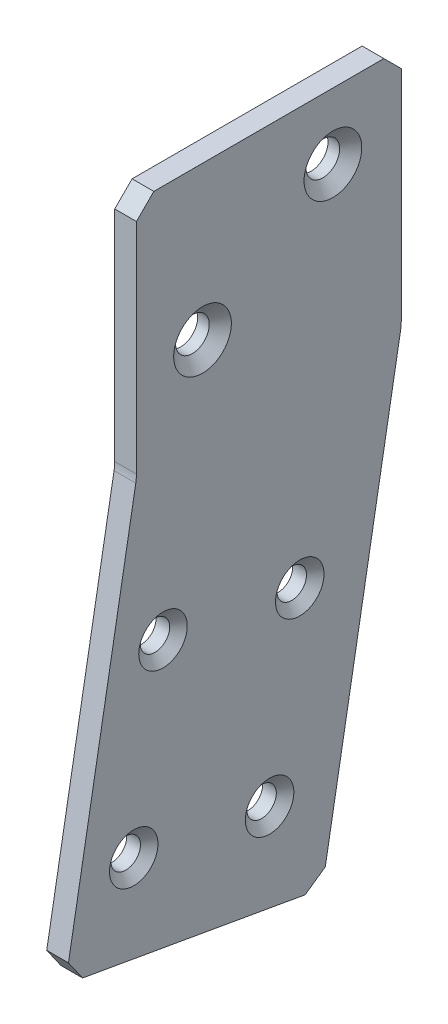
ISO-10303-21;
HEADER;
FILE_DESCRIPTION(('STEP AP214'),'2;1');
FILE_NAME('part.step','',(''),(''),'','','');
FILE_SCHEMA(('AUTOMOTIVE_DESIGN { 1 0 10303 214 1 1 1 1 }'));
ENDSEC;
DATA;
#1=APPLICATION_CONTEXT('core data for automotive mechanical design processes');
#2=APPLICATION_PROTOCOL_DEFINITION('international standard','automotive_design',2000,#1);
#3=PRODUCT_CONTEXT('',#1,'mechanical');
#4=PRODUCT('Part','Part','',(#3));
#5=PRODUCT_RELATED_PRODUCT_CATEGORY('part','',(#4));
#6=PRODUCT_DEFINITION_FORMATION('','',#4);
#7=PRODUCT_DEFINITION_CONTEXT('part definition',#1,'design');
#8=PRODUCT_DEFINITION('design','',#6,#7);
#9=PRODUCT_DEFINITION_SHAPE('','',#8);
#10=(LENGTH_UNIT() NAMED_UNIT(*) SI_UNIT(.MILLI.,.METRE.));
#11=(NAMED_UNIT(*) PLANE_ANGLE_UNIT() SI_UNIT($,.RADIAN.));
#12=(NAMED_UNIT(*) SI_UNIT($,.STERADIAN.) SOLID_ANGLE_UNIT());
#13=UNCERTAINTY_MEASURE_WITH_UNIT(LENGTH_MEASURE(1.E-05),#10,'distance_accuracy_value','');
#14=(GEOMETRIC_REPRESENTATION_CONTEXT(3) GLOBAL_UNCERTAINTY_ASSIGNED_CONTEXT((#13)) GLOBAL_UNIT_ASSIGNED_CONTEXT((#10,
#11,#12)) REPRESENTATION_CONTEXT('',''));
#15=CARTESIAN_POINT('',(0.,0.,0.));
#16=DIRECTION('',(0.,0.,1.));
#17=DIRECTION('',(1.,0.,0.));
#18=AXIS2_PLACEMENT_3D('',#15,#16,#17);
#19=CARTESIAN_POINT('',(8.21082796489774,230.070458845019,-147.775624550014));
#20=DIRECTION('',(0.,0.984807753012208,-0.17364817766693));
#21=DIRECTION('',(0.,0.17364817766693,0.984807753012208));
#22=AXIS2_PLACEMENT_3D('',#19,#20,#21);
#23=PLANE('',#22);
#24=DIRECTION('',(0.,0.17364817766693,0.984807753012208));
#25=VECTOR('',#24,1.);
#26=CARTESIAN_POINT('',(5.03582796489774,230.070458845019,-147.775624550014));
#27=LINE('',#26,#25);
#28=CARTESIAN_POINT('',(5.03582796489774,230.511525216293,-145.274212857363));
#29=VERTEX_POINT('',#28);
#30=CARTESIAN_POINT('',(5.03582796489774,236.245388042855,-112.755860852901));
#31=VERTEX_POINT('',#30);
#32=EDGE_CURVE('E176',#29,#31,#27,.T.);
#33=ORIENTED_EDGE('',*,*,#32,.F.);
#34=DIRECTION('',(-1.,0.,0.));
#35=VECTOR('',#34,1.);
#36=CARTESIAN_POINT('',(8.21082796489774,230.511525216293,-145.274212857363));
#37=LINE('',#36,#35);
#38=CARTESIAN_POINT('',(8.21082796489774,230.511525216293,-145.274212857363));
#39=VERTEX_POINT('',#38);
#40=EDGE_CURVE('E211',#39,#29,#37,.T.);
#41=ORIENTED_EDGE('',*,*,#40,.F.);
#42=DIRECTION('',(0.,0.17364817766693,0.984807753012208));
#43=VECTOR('',#42,1.);
#44=CARTESIAN_POINT('',(8.21082796489774,230.070458845019,-147.775624550014));
#45=LINE('',#44,#43);
#46=CARTESIAN_POINT('',(8.21082796489774,236.245388042855,-112.755860852901));
#47=VERTEX_POINT('',#46);
#48=EDGE_CURVE('E184',#39,#47,#45,.T.);
#49=ORIENTED_EDGE('',*,*,#48,.T.);
#50=DIRECTION('',(1.,0.,0.));
#51=VECTOR('',#50,1.);
#52=CARTESIAN_POINT('',(8.21082796489774,236.245388042855,-112.755860852901));
#53=LINE('',#52,#51);
#54=EDGE_CURVE('E214',#31,#47,#53,.T.);
#55=ORIENTED_EDGE('',*,*,#54,.F.);
#56=EDGE_LOOP('',(#33,#41,#49,#55));
#57=FACE_BOUND('',#56,.T.);
#58=ADVANCED_FACE('F43',(#57),#23,.F.);
#59=CARTESIAN_POINT('',(8.21082796489774,236.686454414129,-110.25444916025));
#60=DIRECTION('',(0.,-0.173648177666931,-0.984807753012208));
#61=DIRECTION('',(0.,0.984807753012208,-0.173648177666931));
#62=AXIS2_PLACEMENT_3D('',#59,#60,#61);
#63=PLANE('',#62);
#64=DIRECTION('',(0.,0.984807753012208,-0.173648177666931));
#65=VECTOR('',#64,1.);
#66=CARTESIAN_POINT('',(8.21082796489774,236.686454414129,-110.25444916025));
#67=LINE('',#66,#65);
#68=CARTESIAN_POINT('',(8.21082796489774,239.18786610678,-110.695515531524));
#69=VERTEX_POINT('',#68);
#70=CARTESIAN_POINT('',(8.21082796489771,294.96406401821,-120.530364104645));
#71=VERTEX_POINT('',#70);
#72=EDGE_CURVE('E248',#69,#71,#67,.T.);
#73=ORIENTED_EDGE('',*,*,#72,.T.);
#74=DIRECTION('',(-1.,0.,0.));
#75=VECTOR('',#74,1.);
#76=CARTESIAN_POINT('',(8.21082796489771,294.96406401821,-120.530364104645));
#77=LINE('',#76,#75);
#78=CARTESIAN_POINT('',(5.03582796489771,294.96406401821,-120.530364104645));
#79=VERTEX_POINT('',#78);
#80=EDGE_CURVE('E162',#79,#71,#77,.F.);
#81=ORIENTED_EDGE('',*,*,#80,.F.);
#82=DIRECTION('',(0.,0.984807753012208,-0.173648177666931));
#83=VECTOR('',#82,1.);
#84=CARTESIAN_POINT('',(5.03582796489774,236.686454414129,-110.25444916025));
#85=LINE('',#84,#83);
#86=CARTESIAN_POINT('',(5.03582796489773,239.18786610678,-110.695515531524));
#87=VERTEX_POINT('',#86);
#88=EDGE_CURVE('E147',#87,#79,#85,.T.);
#89=ORIENTED_EDGE('',*,*,#88,.F.);
#90=DIRECTION('',(-1.,0.,0.));
#91=VECTOR('',#90,1.);
#92=CARTESIAN_POINT('',(8.21082796489774,239.18786610678,-110.695515531524));
#93=LINE('',#92,#91);
#94=EDGE_CURVE('E199',#69,#87,#93,.T.);
#95=ORIENTED_EDGE('',*,*,#94,.F.);
#96=EDGE_LOOP('',(#73,#81,#89,#95));
#97=FACE_BOUND('',#96,.T.);
#98=ADVANCED_FACE('F272',(#97),#63,.F.);
#99=CARTESIAN_POINT('',(8.2108279648977,330.563176933005,-120.626834873017));
#100=DIRECTION('',(0.,0.,-1.));
#101=DIRECTION('',(0.,1.,0.));
#102=AXIS2_PLACEMENT_3D('',#99,#100,#101);
#103=PLANE('',#102);
#104=DIRECTION('',(0.,1.,0.));
#105=VECTOR('',#104,1.);
#106=CARTESIAN_POINT('',(5.0358279648977,330.563176933005,-120.626834873017));
#107=LINE('',#106,#105);
#108=CARTESIAN_POINT('',(5.03582796489771,296.066729946395,-120.626834873017));
#109=VERTEX_POINT('',#108);
#110=CARTESIAN_POINT('',(5.0358279648977,328.023176933005,-120.626834873017));
#111=VERTEX_POINT('',#110);
#112=EDGE_CURVE('E145',#109,#111,#107,.T.);
#113=ORIENTED_EDGE('',*,*,#112,.F.);
#114=DIRECTION('',(-1.,0.,0.));
#115=VECTOR('',#114,1.);
#116=CARTESIAN_POINT('',(5.03582796489771,296.066729946395,-120.626834873017));
#117=LINE('',#116,#115);
#118=CARTESIAN_POINT('',(8.21082796489771,296.066729946395,-120.626834873017));
#119=VERTEX_POINT('',#118);
#120=EDGE_CURVE('E156',#119,#109,#117,.T.);
#121=ORIENTED_EDGE('',*,*,#120,.F.);
#122=DIRECTION('',(0.,1.,0.));
#123=VECTOR('',#122,1.);
#124=CARTESIAN_POINT('',(8.2108279648977,330.563176933005,-120.626834873017));
#125=LINE('',#124,#123);
#126=CARTESIAN_POINT('',(8.2108279648977,328.023176933005,-120.626834873017));
#127=VERTEX_POINT('',#126);
#128=EDGE_CURVE('E243',#119,#127,#125,.T.);
#129=ORIENTED_EDGE('',*,*,#128,.T.);
#130=DIRECTION('',(1.,0.,0.));
#131=VECTOR('',#130,1.);
#132=CARTESIAN_POINT('',(8.2108279648977,328.023176933005,-120.626834873017));
#133=LINE('',#132,#131);
#134=EDGE_CURVE('E11',#111,#127,#133,.T.);
#135=ORIENTED_EDGE('',*,*,#134,.F.);
#136=EDGE_LOOP('',(#113,#121,#129,#135));
#137=FACE_BOUND('',#136,.T.);
#138=ADVANCED_FACE('F166',(#137),#103,.F.);
#139=CARTESIAN_POINT('',(8.2108279648977,330.563176933005,-159.314588785863));
#140=DIRECTION('',(0.,-1.,0.));
#141=DIRECTION('',(-1.,0.,0.));
#142=AXIS2_PLACEMENT_3D('',#139,#140,#141);
#143=PLANE('',#142);
#144=DIRECTION('',(0.,0.,-1.));
#145=VECTOR('',#144,1.);
#146=CARTESIAN_POINT('',(5.0358279648977,330.563176933005,-159.314588785863));
#147=LINE('',#146,#145);
#148=CARTESIAN_POINT('',(5.0358279648977,330.563176933005,-123.166834873017));
#149=VERTEX_POINT('',#148);
#150=CARTESIAN_POINT('',(5.0358279648977,330.563176933005,-156.774588785863));
#151=VERTEX_POINT('',#150);
#152=EDGE_CURVE('E168',#149,#151,#147,.T.);
#153=ORIENTED_EDGE('',*,*,#152,.F.);
#154=DIRECTION('',(-1.,0.,0.));
#155=VECTOR('',#154,1.);
#156=CARTESIAN_POINT('',(8.2108279648977,330.563176933005,-123.166834873017));
#157=LINE('',#156,#155);
#158=CARTESIAN_POINT('',(8.2108279648977,330.563176933005,-123.166834873017));
#159=VERTEX_POINT('',#158);
#160=EDGE_CURVE('E230',#159,#149,#157,.T.);
#161=ORIENTED_EDGE('',*,*,#160,.F.);
#162=DIRECTION('',(0.,0.,-1.));
#163=VECTOR('',#162,1.);
#164=CARTESIAN_POINT('',(8.2108279648977,330.563176933005,-159.314588785863));
#165=LINE('',#164,#163);
#166=CARTESIAN_POINT('',(8.2108279648977,330.563176933005,-156.774588785863));
#167=VERTEX_POINT('',#166);
#168=EDGE_CURVE('E239',#159,#167,#165,.T.);
#169=ORIENTED_EDGE('',*,*,#168,.T.);
#170=DIRECTION('',(1.,0.,0.));
#171=VECTOR('',#170,1.);
#172=CARTESIAN_POINT('',(8.2108279648977,330.563176933005,-156.774588785863));
#173=LINE('',#172,#171);
#174=EDGE_CURVE('E52',#151,#167,#173,.T.);
#175=ORIENTED_EDGE('',*,*,#174,.F.);
#176=EDGE_LOOP('',(#153,#161,#169,#175));
#177=FACE_BOUND('',#176,.T.);
#178=ADVANCED_FACE('F240',(#177),#143,.F.);
#179=CARTESIAN_POINT('',(8.21082796489771,295.511176933005,-159.314588785863));
#180=DIRECTION('',(0.,0.,1.));
#181=DIRECTION('',(0.,-1.,0.));
#182=AXIS2_PLACEMENT_3D('',#179,#180,#181);
#183=PLANE('',#182);
#184=DIRECTION('',(0.,-1.,0.));
#185=VECTOR('',#184,1.);
#186=CARTESIAN_POINT('',(8.21082796489771,295.511176933005,-159.314588785863));
#187=LINE('',#186,#185);
#188=CARTESIAN_POINT('',(8.2108279648977,328.023176933005,-159.314588785863));
#189=VERTEX_POINT('',#188);
#190=CARTESIAN_POINT('',(8.21082796489771,296.066729946395,-159.314588785863));
#191=VERTEX_POINT('',#190);
#192=EDGE_CURVE('E242',#189,#191,#187,.T.);
#193=ORIENTED_EDGE('',*,*,#192,.T.);
#194=DIRECTION('',(-1.,0.,0.));
#195=VECTOR('',#194,1.);
#196=CARTESIAN_POINT('',(8.21082796489771,296.066729946395,-159.314588785863));
#197=LINE('',#196,#195);
#198=CARTESIAN_POINT('',(5.03582796489771,296.066729946395,-159.314588785863));
#199=VERTEX_POINT('',#198);
#200=EDGE_CURVE('E193',#199,#191,#197,.F.);
#201=ORIENTED_EDGE('',*,*,#200,.F.);
#202=DIRECTION('',(0.,-1.,0.));
#203=VECTOR('',#202,1.);
#204=CARTESIAN_POINT('',(5.03582796489771,295.511176933005,-159.314588785863));
#205=LINE('',#204,#203);
#206=CARTESIAN_POINT('',(5.0358279648977,328.023176933005,-159.314588785863));
#207=VERTEX_POINT('',#206);
#208=EDGE_CURVE('E173',#207,#199,#205,.T.);
#209=ORIENTED_EDGE('',*,*,#208,.F.);
#210=DIRECTION('',(-1.,0.,0.));
#211=VECTOR('',#210,1.);
#212=CARTESIAN_POINT('',(8.2108279648977,328.023176933005,-159.314588785863));
#213=LINE('',#212,#211);
#214=EDGE_CURVE('E227',#189,#207,#213,.T.);
#215=ORIENTED_EDGE('',*,*,#214,.F.);
#216=EDGE_LOOP('',(#193,#201,#209,#215));
#217=FACE_BOUND('',#216,.T.);
#218=ADVANCED_FACE('F278',(#217),#183,.F.);
#219=CARTESIAN_POINT('',(8.21082796489774,230.070458845019,-147.775624550014));
#220=DIRECTION('',(0.,0.173648177666931,0.984807753012208));
#221=DIRECTION('',(0.,-0.984807753012208,0.173648177666931));
#222=AXIS2_PLACEMENT_3D('',#219,#220,#221);
#223=PLANE('',#222);
#224=DIRECTION('',(0.,-0.984807753012208,0.173648177666931));
#225=VECTOR('',#224,1.);
#226=CARTESIAN_POINT('',(5.03582796489774,230.070458845019,-147.775624550014));
#227=LINE('',#226,#225);
#228=CARTESIAN_POINT('',(5.03582796489771,294.96406401821,-159.21811801749));
#229=VERTEX_POINT('',#228);
#230=CARTESIAN_POINT('',(5.03582796489774,232.57187053767,-148.216690921288));
#231=VERTEX_POINT('',#230);
#232=EDGE_CURVE('E182',#229,#231,#227,.T.);
#233=ORIENTED_EDGE('',*,*,#232,.F.);
#234=DIRECTION('',(-1.,0.,0.));
#235=VECTOR('',#234,1.);
#236=CARTESIAN_POINT('',(8.21082796489771,294.96406401821,-159.21811801749));
#237=LINE('',#236,#235);
#238=CARTESIAN_POINT('',(8.21082796489771,294.96406401821,-159.21811801749));
#239=VERTEX_POINT('',#238);
#240=EDGE_CURVE('E188',#239,#229,#237,.T.);
#241=ORIENTED_EDGE('',*,*,#240,.F.);
#242=DIRECTION('',(0.,-0.984807753012208,0.173648177666931));
#243=VECTOR('',#242,1.);
#244=CARTESIAN_POINT('',(8.21082796489774,230.070458845019,-147.775624550014));
#245=LINE('',#244,#243);
#246=CARTESIAN_POINT('',(8.21082796489774,232.57187053767,-148.216690921288));
#247=VERTEX_POINT('',#246);
#248=EDGE_CURVE('E163',#239,#247,#245,.T.);
#249=ORIENTED_EDGE('',*,*,#248,.T.);
#250=DIRECTION('',(1.,0.,0.));
#251=VECTOR('',#250,1.);
#252=CARTESIAN_POINT('',(8.21082796489774,232.57187053767,-148.216690921288));
#253=LINE('',#252,#251);
#254=EDGE_CURVE('E224',#231,#247,#253,.T.);
#255=ORIENTED_EDGE('',*,*,#254,.F.);
#256=EDGE_LOOP('',(#233,#241,#249,#255));
#257=FACE_BOUND('',#256,.T.);
#258=ADVANCED_FACE('F286',(#257),#223,.F.);
#259=CARTESIAN_POINT('',(8.21082796489783,0.,0.));
#260=DIRECTION('',(1.,0.,0.));
#261=DIRECTION('',(0.,-1.,0.));
#262=AXIS2_PLACEMENT_3D('',#259,#260,#261);
#263=PLANE('',#262);
#264=CARTESIAN_POINT('',(8.2108279648977,320.911176933005,-149.328834873017));
#265=DIRECTION('',(-1.,0.,0.));
#266=DIRECTION('',(0.,0.,1.));
#267=AXIS2_PLACEMENT_3D('',#264,#265,#266);
#268=CIRCLE('',#267,4.21640000000001);
#269=CARTESIAN_POINT('',(8.2108279648977,320.911176933005,-145.112434873017));
#270=VERTEX_POINT('',#269);
#271=EDGE_CURVE('E514',#270,#270,#268,.T.);
#272=ORIENTED_EDGE('',*,*,#271,.T.);
#273=EDGE_LOOP('',(#272));
#274=FACE_BOUND('',#273,.T.);
#275=CARTESIAN_POINT('',(8.21082796489771,308.211176933005,-130.278834873017));
#276=DIRECTION('',(-1.,0.,0.));
#277=DIRECTION('',(0.,0.,1.));
#278=AXIS2_PLACEMENT_3D('',#275,#276,#277);
#279=CIRCLE('',#278,4.21640000000001);
#280=CARTESIAN_POINT('',(8.21082796489771,308.211176933005,-126.062434873017));
#281=VERTEX_POINT('',#280);
#282=EDGE_CURVE('E518',#281,#281,#279,.T.);
#283=ORIENTED_EDGE('',*,*,#282,.T.);
#284=EDGE_LOOP('',(#283));
#285=FACE_BOUND('',#284,.T.);
#286=CARTESIAN_POINT('',(8.21082796489772,273.13941545584,-124.504125042983));
#287=DIRECTION('',(-1.,0.,0.));
#288=DIRECTION('',(0.,0.,1.));
#289=AXIS2_PLACEMENT_3D('',#286,#287,#288);
#290=CIRCLE('',#289,3.54329999999997);
#291=CARTESIAN_POINT('',(8.21082796489772,273.13941545584,-120.960825042983));
#292=VERTEX_POINT('',#291);
#293=EDGE_CURVE('E534',#292,#292,#290,.T.);
#294=ORIENTED_EDGE('',*,*,#293,.T.);
#295=EDGE_LOOP('',(#294));
#296=FACE_BOUND('',#295,.T.);
#297=CARTESIAN_POINT('',(8.21082796489772,269.72417914843,-144.485224024571));
#298=DIRECTION('',(-1.,0.,0.));
#299=DIRECTION('',(0.,0.,1.));
#300=AXIS2_PLACEMENT_3D('',#297,#298,#299);
#301=CIRCLE('',#300,3.54329999999997);
#302=CARTESIAN_POINT('',(8.21082796489772,269.72417914843,-140.941924024571));
#303=VERTEX_POINT('',#302);
#304=EDGE_CURVE('E543',#303,#303,#301,.T.);
#305=ORIENTED_EDGE('',*,*,#304,.T.);
#306=EDGE_LOOP('',(#305));
#307=FACE_BOUND('',#306,.T.);
#308=CARTESIAN_POINT('',(8.21082796489773,244.32417914843,-140.075144867288));
#309=DIRECTION('',(-1.,0.,0.));
#310=DIRECTION('',(0.,0.,1.));
#311=AXIS2_PLACEMENT_3D('',#308,#309,#310);
#312=CIRCLE('',#311,3.5433);
#313=CARTESIAN_POINT('',(8.21082796489773,244.32417914843,-136.531844867288));
#314=VERTEX_POINT('',#313);
#315=EDGE_CURVE('E552',#314,#314,#312,.T.);
#316=ORIENTED_EDGE('',*,*,#315,.T.);
#317=EDGE_LOOP('',(#316));
#318=FACE_BOUND('',#317,.T.);
#319=CARTESIAN_POINT('',(8.21082796489773,247.716621745922,-120.227402213944));
#320=DIRECTION('',(-1.,0.,0.));
#321=DIRECTION('',(0.,0.,1.));
#322=AXIS2_PLACEMENT_3D('',#319,#320,#321);
#323=CIRCLE('',#322,3.54330000000003);
#324=CARTESIAN_POINT('',(8.21082796489773,247.716621745922,-116.684102213944));
#325=VERTEX_POINT('',#324);
#326=EDGE_CURVE('E262',#325,#325,#323,.T.);
#327=ORIENTED_EDGE('',*,*,#326,.T.);
#328=EDGE_LOOP('',(#327));
#329=FACE_BOUND('',#328,.T.);
#330=ORIENTED_EDGE('',*,*,#48,.F.);
#331=DIRECTION('',(0.,0.573576436351044,-0.819152044288993));
#332=VECTOR('',#331,1.);
#333=CARTESIAN_POINT('',(8.2108279648978,86.419002148222,60.5112367487458));
#334=LINE('',#333,#332);
#335=EDGE_CURVE('E220',#247,#39,#334,.F.);
#336=ORIENTED_EDGE('',*,*,#335,.F.);
#337=ORIENTED_EDGE('',*,*,#248,.F.);
#338=CARTESIAN_POINT('',(8.21082796489771,296.066729946395,-152.964588785863));
#339=DIRECTION('',(-1.,0.,0.));
#340=DIRECTION('',(0.,-1.,0.));
#341=AXIS2_PLACEMENT_3D('',#338,#339,#340);
#342=CIRCLE('',#341,6.35);
#343=EDGE_CURVE('E153',#191,#239,#342,.T.);
#344=ORIENTED_EDGE('',*,*,#343,.F.);
#345=ORIENTED_EDGE('',*,*,#192,.F.);
#346=DIRECTION('',(0.,0.707106781186548,0.707106781186548));
#347=VECTOR('',#346,1.);
#348=CARTESIAN_POINT('',(8.21082796489772,243.668882859434,-243.668882859434));
#349=LINE('',#348,#347);
#350=EDGE_CURVE('E59',#167,#189,#349,.F.);
#351=ORIENTED_EDGE('',*,*,#350,.F.);
#352=ORIENTED_EDGE('',*,*,#168,.F.);
#353=DIRECTION('',(0.,-0.707106781186548,0.707106781186548));
#354=VECTOR('',#353,1.);
#355=CARTESIAN_POINT('',(8.2108279648978,103.698171029994,103.698171029994));
#356=LINE('',#355,#354);
#357=EDGE_CURVE('E69',#127,#159,#356,.F.);
#358=ORIENTED_EDGE('',*,*,#357,.F.);
#359=ORIENTED_EDGE('',*,*,#128,.F.);
#360=CARTESIAN_POINT('',(8.21082796489771,296.066729946395,-114.276834873017));
#361=DIRECTION('',(-1.,0.,0.));
#362=DIRECTION('',(0.,-1.,0.));
#363=AXIS2_PLACEMENT_3D('',#360,#361,#362);
#364=CIRCLE('',#363,6.35);
#365=EDGE_CURVE('E152',#71,#119,#364,.F.);
#366=ORIENTED_EDGE('',*,*,#365,.F.);
#367=ORIENTED_EDGE('',*,*,#72,.F.);
#368=DIRECTION('',(0.,-0.819152044288992,-0.573576436351046));
#369=VECTOR('',#368,1.);
#370=CARTESIAN_POINT('',(8.21082796489777,130.700278479122,-186.659342190597));
#371=LINE('',#370,#369);
#372=EDGE_CURVE('E222',#47,#69,#371,.F.);
#373=ORIENTED_EDGE('',*,*,#372,.F.);
#374=EDGE_LOOP('',(#330,#336,#337,#344,#345,#351,#352,#358,#359,#366,#367,#373));
#375=FACE_BOUND('',#374,.T.);
#376=ADVANCED_FACE('F274',(#274,#285,#296,#307,#318,#329,#375),#263,.T.);
#377=CARTESIAN_POINT('',(5.03582796489783,0.,0.));
#378=DIRECTION('',(1.,0.,0.));
#379=DIRECTION('',(0.,-1.,0.));
#380=AXIS2_PLACEMENT_3D('',#377,#378,#379);
#381=PLANE('',#380);
#382=CARTESIAN_POINT('',(5.03582796489763,320.911176933005,-149.328834873017));
#383=DIRECTION('',(-1.,0.,0.));
#384=DIRECTION('',(0.,0.,1.));
#385=AXIS2_PLACEMENT_3D('',#382,#383,#384);
#386=CIRCLE('',#385,2.45744999999997);
#387=CARTESIAN_POINT('',(5.03582796489763,320.911176933005,-146.871384873017));
#388=VERTEX_POINT('',#387);
#389=EDGE_CURVE('E509',#388,#388,#386,.T.);
#390=ORIENTED_EDGE('',*,*,#389,.F.);
#391=EDGE_LOOP('',(#390));
#392=FACE_BOUND('',#391,.T.);
#393=CARTESIAN_POINT('',(5.03582796489764,308.211176933005,-130.278834873017));
#394=DIRECTION('',(-1.,0.,0.));
#395=DIRECTION('',(0.,0.,1.));
#396=AXIS2_PLACEMENT_3D('',#393,#394,#395);
#397=CIRCLE('',#396,2.45744999999997);
#398=CARTESIAN_POINT('',(5.03582796489764,308.211176933005,-127.821384873017));
#399=VERTEX_POINT('',#398);
#400=EDGE_CURVE('E530',#399,#399,#397,.T.);
#401=ORIENTED_EDGE('',*,*,#400,.F.);
#402=EDGE_LOOP('',(#401));
#403=FACE_BOUND('',#402,.T.);
#404=CARTESIAN_POINT('',(5.03582796489768,273.13941545584,-124.504125042983));
#405=DIRECTION('',(-1.,0.,0.));
#406=DIRECTION('',(0.,0.,1.));
#407=AXIS2_PLACEMENT_3D('',#404,#405,#406);
#408=CIRCLE('',#407,2.15264999999998);
#409=CARTESIAN_POINT('',(5.03582796489768,273.13941545584,-122.351475042983));
#410=VERTEX_POINT('',#409);
#411=EDGE_CURVE('E540',#410,#410,#408,.T.);
#412=ORIENTED_EDGE('',*,*,#411,.F.);
#413=EDGE_LOOP('',(#412));
#414=FACE_BOUND('',#413,.T.);
#415=CARTESIAN_POINT('',(5.03582796489768,269.72417914843,-144.485224024571));
#416=DIRECTION('',(-1.,0.,0.));
#417=DIRECTION('',(0.,0.,1.));
#418=AXIS2_PLACEMENT_3D('',#415,#416,#417);
#419=CIRCLE('',#418,2.15264999999998);
#420=CARTESIAN_POINT('',(5.03582796489768,269.72417914843,-142.332574024571));
#421=VERTEX_POINT('',#420);
#422=EDGE_CURVE('E549',#421,#421,#419,.T.);
#423=ORIENTED_EDGE('',*,*,#422,.F.);
#424=EDGE_LOOP('',(#423));
#425=FACE_BOUND('',#424,.T.);
#426=CARTESIAN_POINT('',(5.03582796489769,244.32417914843,-140.075144867288));
#427=DIRECTION('',(-1.,0.,0.));
#428=DIRECTION('',(0.,0.,1.));
#429=AXIS2_PLACEMENT_3D('',#426,#427,#428);
#430=CIRCLE('',#429,2.15265000000001);
#431=CARTESIAN_POINT('',(5.03582796489769,244.32417914843,-137.922494867288));
#432=VERTEX_POINT('',#431);
#433=EDGE_CURVE('E558',#432,#432,#430,.T.);
#434=ORIENTED_EDGE('',*,*,#433,.F.);
#435=EDGE_LOOP('',(#434));
#436=FACE_BOUND('',#435,.T.);
#437=CARTESIAN_POINT('',(5.03582796489769,247.716621745922,-120.227402213944));
#438=DIRECTION('',(-1.,0.,0.));
#439=DIRECTION('',(0.,0.,1.));
#440=AXIS2_PLACEMENT_3D('',#437,#438,#439);
#441=CIRCLE('',#440,2.15265000000001);
#442=CARTESIAN_POINT('',(5.03582796489769,247.716621745922,-118.074752213944));
#443=VERTEX_POINT('',#442);
#444=EDGE_CURVE('E254',#443,#443,#441,.T.);
#445=ORIENTED_EDGE('',*,*,#444,.F.);
#446=EDGE_LOOP('',(#445));
#447=FACE_BOUND('',#446,.T.);
#448=ORIENTED_EDGE('',*,*,#88,.T.);
#449=CARTESIAN_POINT('',(5.03582796489771,296.066729946395,-114.276834873017));
#450=DIRECTION('',(-1.,0.,0.));
#451=DIRECTION('',(0.,-1.,0.));
#452=AXIS2_PLACEMENT_3D('',#449,#450,#451);
#453=CIRCLE('',#452,6.35);
#454=EDGE_CURVE('E141',#109,#79,#453,.T.);
#455=ORIENTED_EDGE('',*,*,#454,.F.);
#456=ORIENTED_EDGE('',*,*,#112,.T.);
#457=DIRECTION('',(0.,0.707106781186548,-0.707106781186548));
#458=VECTOR('',#457,1.);
#459=CARTESIAN_POINT('',(5.0358279648977,330.563176933005,-123.166834873017));
#460=LINE('',#459,#458);
#461=EDGE_CURVE('E202',#149,#111,#460,.F.);
#462=ORIENTED_EDGE('',*,*,#461,.F.);
#463=ORIENTED_EDGE('',*,*,#152,.T.);
#464=DIRECTION('',(0.,-0.707106781186548,-0.707106781186548));
#465=VECTOR('',#464,1.);
#466=CARTESIAN_POINT('',(5.0358279648977,328.023176933005,-159.314588785863));
#467=LINE('',#466,#465);
#468=EDGE_CURVE('E205',#207,#151,#467,.F.);
#469=ORIENTED_EDGE('',*,*,#468,.F.);
#470=ORIENTED_EDGE('',*,*,#208,.T.);
#471=CARTESIAN_POINT('',(5.03582796489771,296.066729946395,-152.964588785863));
#472=DIRECTION('',(-1.,0.,0.));
#473=DIRECTION('',(0.,-1.,0.));
#474=AXIS2_PLACEMENT_3D('',#471,#472,#473);
#475=CIRCLE('',#474,6.35);
#476=EDGE_CURVE('E191',#229,#199,#475,.F.);
#477=ORIENTED_EDGE('',*,*,#476,.F.);
#478=ORIENTED_EDGE('',*,*,#232,.T.);
#479=DIRECTION('',(0.,-0.573576436351044,0.819152044288993));
#480=VECTOR('',#479,1.);
#481=CARTESIAN_POINT('',(5.03582796489774,230.511525216293,-145.274212857363));
#482=LINE('',#481,#480);
#483=EDGE_CURVE('E207',#29,#231,#482,.F.);
#484=ORIENTED_EDGE('',*,*,#483,.F.);
#485=ORIENTED_EDGE('',*,*,#32,.T.);
#486=DIRECTION('',(0.,0.819152044288992,0.573576436351046));
#487=VECTOR('',#486,1.);
#488=CARTESIAN_POINT('',(5.03582796489774,239.18786610678,-110.695515531524));
#489=LINE('',#488,#487);
#490=EDGE_CURVE('E209',#87,#31,#489,.F.);
#491=ORIENTED_EDGE('',*,*,#490,.F.);
#492=EDGE_LOOP('',(#448,#455,#456,#462,#463,#469,#470,#477,#478,#484,#485,#491));
#493=FACE_BOUND('',#492,.T.);
#494=ADVANCED_FACE('F143',(#392,#403,#414,#425,#436,#447,#493),#381,.F.);
#495=CARTESIAN_POINT('',(8.21082796489771,296.066729946395,-114.276834873017));
#496=DIRECTION('',(1.,0.,0.));
#497=DIRECTION('',(0.,-1.,0.));
#498=AXIS2_PLACEMENT_3D('',#495,#496,#497);
#499=CYLINDRICAL_SURFACE('',#498,6.35);
#500=ORIENTED_EDGE('',*,*,#365,.T.);
#501=ORIENTED_EDGE('',*,*,#120,.T.);
#502=ORIENTED_EDGE('',*,*,#454,.T.);
#503=ORIENTED_EDGE('',*,*,#80,.T.);
#504=EDGE_LOOP('',(#500,#501,#502,#503));
#505=FACE_BOUND('',#504,.T.);
#506=ADVANCED_FACE('F157',(#505),#499,.F.);
#507=CARTESIAN_POINT('',(8.21082796489771,296.066729946395,-152.964588785863));
#508=DIRECTION('',(-1.,0.,0.));
#509=DIRECTION('',(0.,1.,0.));
#510=AXIS2_PLACEMENT_3D('',#507,#508,#509);
#511=CYLINDRICAL_SURFACE('',#510,6.35);
#512=ORIENTED_EDGE('',*,*,#343,.T.);
#513=ORIENTED_EDGE('',*,*,#240,.T.);
#514=ORIENTED_EDGE('',*,*,#476,.T.);
#515=ORIENTED_EDGE('',*,*,#200,.T.);
#516=EDGE_LOOP('',(#512,#513,#514,#515));
#517=FACE_BOUND('',#516,.T.);
#518=ADVANCED_FACE('F280',(#517),#511,.T.);
#519=CARTESIAN_POINT('',(8.21082796489773,247.716621745922,-120.227402213944));
#520=DIRECTION('',(1.,0.,0.));
#521=DIRECTION('',(0.,0.,1.));
#522=AXIS2_PLACEMENT_3D('',#519,#520,#521);
#523=CYLINDRICAL_SURFACE('',#522,2.15264999999999);
#524=ORIENTED_EDGE('',*,*,#444,.T.);
#525=EDGE_LOOP('',(#524));
#526=FACE_BOUND('',#525,.T.);
#527=CARTESIAN_POINT('',(7.04393406280105,247.716621745922,-120.227402213944));
#528=DIRECTION('',(-1.,0.,0.));
#529=DIRECTION('',(0.,0.,1.));
#530=AXIS2_PLACEMENT_3D('',#527,#528,#529);
#531=CIRCLE('',#530,2.15264999999998);
#532=CARTESIAN_POINT('',(7.04393406280105,247.716621745922,-118.074752213944));
#533=VERTEX_POINT('',#532);
#534=EDGE_CURVE('E257',#533,#533,#531,.T.);
#535=ORIENTED_EDGE('',*,*,#534,.F.);
#536=EDGE_LOOP('',(#535));
#537=FACE_BOUND('',#536,.T.);
#538=ADVANCED_FACE('F316',(#526,#537),#523,.F.);
#539=CARTESIAN_POINT('',(8.21082796489773,247.716621745922,-120.227402213944));
#540=DIRECTION('',(1.,0.,0.));
#541=DIRECTION('',(0.,0.,1.));
#542=AXIS2_PLACEMENT_3D('',#539,#540,#541);
#543=CONICAL_SURFACE('',#542,3.54330000000003,0.872664625997184);
#544=ORIENTED_EDGE('',*,*,#534,.T.);
#545=EDGE_LOOP('',(#544));
#546=FACE_BOUND('',#545,.T.);
#547=ORIENTED_EDGE('',*,*,#326,.F.);
#548=EDGE_LOOP('',(#547));
#549=FACE_BOUND('',#548,.T.);
#550=ADVANCED_FACE('F320',(#546,#549),#543,.F.);
#551=CARTESIAN_POINT('',(8.21082796489773,244.32417914843,-140.075144867288));
#552=DIRECTION('',(1.,0.,0.));
#553=DIRECTION('',(0.,0.,1.));
#554=AXIS2_PLACEMENT_3D('',#551,#552,#553);
#555=CYLINDRICAL_SURFACE('',#554,2.15264999999999);
#556=ORIENTED_EDGE('',*,*,#433,.T.);
#557=EDGE_LOOP('',(#556));
#558=FACE_BOUND('',#557,.T.);
#559=CARTESIAN_POINT('',(7.04393406280105,244.32417914843,-140.075144867288));
#560=DIRECTION('',(-1.,0.,0.));
#561=DIRECTION('',(0.,0.,1.));
#562=AXIS2_PLACEMENT_3D('',#559,#560,#561);
#563=CIRCLE('',#562,2.15264999999998);
#564=CARTESIAN_POINT('',(7.04393406280105,244.32417914843,-137.922494867288));
#565=VERTEX_POINT('',#564);
#566=EDGE_CURVE('E555',#565,#565,#563,.T.);
#567=ORIENTED_EDGE('',*,*,#566,.F.);
#568=EDGE_LOOP('',(#567));
#569=FACE_BOUND('',#568,.T.);
#570=ADVANCED_FACE('F325',(#558,#569),#555,.F.);
#571=CARTESIAN_POINT('',(8.21082796489773,244.32417914843,-140.075144867288));
#572=DIRECTION('',(1.,0.,0.));
#573=DIRECTION('',(0.,0.,1.));
#574=AXIS2_PLACEMENT_3D('',#571,#572,#573);
#575=CONICAL_SURFACE('',#574,3.5433,0.872664625997174);
#576=ORIENTED_EDGE('',*,*,#566,.T.);
#577=EDGE_LOOP('',(#576));
#578=FACE_BOUND('',#577,.T.);
#579=ORIENTED_EDGE('',*,*,#315,.F.);
#580=EDGE_LOOP('',(#579));
#581=FACE_BOUND('',#580,.T.);
#582=ADVANCED_FACE('F394',(#578,#581),#575,.F.);
#583=CARTESIAN_POINT('',(8.21082796489772,269.72417914843,-144.485224024571));
#584=DIRECTION('',(1.,0.,0.));
#585=DIRECTION('',(0.,0.,1.));
#586=AXIS2_PLACEMENT_3D('',#583,#584,#585);
#587=CYLINDRICAL_SURFACE('',#586,2.15264999999998);
#588=ORIENTED_EDGE('',*,*,#422,.T.);
#589=EDGE_LOOP('',(#588));
#590=FACE_BOUND('',#589,.T.);
#591=CARTESIAN_POINT('',(7.04393406280104,269.72417914843,-144.485224024571));
#592=DIRECTION('',(-1.,0.,0.));
#593=DIRECTION('',(0.,0.,1.));
#594=AXIS2_PLACEMENT_3D('',#591,#592,#593);
#595=CIRCLE('',#594,2.15264999999998);
#596=CARTESIAN_POINT('',(7.04393406280104,269.72417914843,-142.332574024571));
#597=VERTEX_POINT('',#596);
#598=EDGE_CURVE('E546',#597,#597,#595,.T.);
#599=ORIENTED_EDGE('',*,*,#598,.F.);
#600=EDGE_LOOP('',(#599));
#601=FACE_BOUND('',#600,.T.);
#602=ADVANCED_FACE('F403',(#590,#601),#587,.F.);
#603=CARTESIAN_POINT('',(8.21082796489772,269.72417914843,-144.485224024571));
#604=DIRECTION('',(1.,0.,0.));
#605=DIRECTION('',(0.,0.,1.));
#606=AXIS2_PLACEMENT_3D('',#603,#604,#605);
#607=CONICAL_SURFACE('',#606,3.54329999999997,0.872664625997165);
#608=ORIENTED_EDGE('',*,*,#598,.T.);
#609=EDGE_LOOP('',(#608));
#610=FACE_BOUND('',#609,.T.);
#611=ORIENTED_EDGE('',*,*,#304,.F.);
#612=EDGE_LOOP('',(#611));
#613=FACE_BOUND('',#612,.T.);
#614=ADVANCED_FACE('F413',(#610,#613),#607,.F.);
#615=CARTESIAN_POINT('',(8.21082796489772,273.13941545584,-124.504125042983));
#616=DIRECTION('',(1.,0.,0.));
#617=DIRECTION('',(0.,0.,1.));
#618=AXIS2_PLACEMENT_3D('',#615,#616,#617);
#619=CYLINDRICAL_SURFACE('',#618,2.15264999999998);
#620=ORIENTED_EDGE('',*,*,#411,.T.);
#621=EDGE_LOOP('',(#620));
#622=FACE_BOUND('',#621,.T.);
#623=CARTESIAN_POINT('',(7.04393406280104,273.13941545584,-124.504125042983));
#624=DIRECTION('',(-1.,0.,0.));
#625=DIRECTION('',(0.,0.,1.));
#626=AXIS2_PLACEMENT_3D('',#623,#624,#625);
#627=CIRCLE('',#626,2.15264999999998);
#628=CARTESIAN_POINT('',(7.04393406280104,273.13941545584,-122.351475042983));
#629=VERTEX_POINT('',#628);
#630=EDGE_CURVE('E537',#629,#629,#627,.T.);
#631=ORIENTED_EDGE('',*,*,#630,.F.);
#632=EDGE_LOOP('',(#631));
#633=FACE_BOUND('',#632,.T.);
#634=ADVANCED_FACE('F423',(#622,#633),#619,.F.);
#635=CARTESIAN_POINT('',(8.21082796489772,273.13941545584,-124.504125042983));
#636=DIRECTION('',(1.,0.,0.));
#637=DIRECTION('',(0.,0.,1.));
#638=AXIS2_PLACEMENT_3D('',#635,#636,#637);
#639=CONICAL_SURFACE('',#638,3.54329999999997,0.872664625997165);
#640=ORIENTED_EDGE('',*,*,#630,.T.);
#641=EDGE_LOOP('',(#640));
#642=FACE_BOUND('',#641,.T.);
#643=ORIENTED_EDGE('',*,*,#293,.F.);
#644=EDGE_LOOP('',(#643));
#645=FACE_BOUND('',#644,.T.);
#646=ADVANCED_FACE('F433',(#642,#645),#639,.F.);
#647=CARTESIAN_POINT('',(8.21082796489771,308.211176933005,-130.278834873017));
#648=DIRECTION('',(1.,0.,0.));
#649=DIRECTION('',(0.,0.,1.));
#650=AXIS2_PLACEMENT_3D('',#647,#648,#649);
#651=CYLINDRICAL_SURFACE('',#650,2.45744999999997);
#652=ORIENTED_EDGE('',*,*,#400,.T.);
#653=EDGE_LOOP('',(#652));
#654=FACE_BOUND('',#653,.T.);
#655=CARTESIAN_POINT('',(6.73489366863843,308.211176933005,-130.278834873017));
#656=DIRECTION('',(-1.,0.,0.));
#657=DIRECTION('',(0.,0.,1.));
#658=AXIS2_PLACEMENT_3D('',#655,#656,#657);
#659=CIRCLE('',#658,2.45744999999997);
#660=CARTESIAN_POINT('',(6.73489366863843,308.211176933005,-127.821384873017));
#661=VERTEX_POINT('',#660);
#662=EDGE_CURVE('E526',#661,#661,#659,.T.);
#663=ORIENTED_EDGE('',*,*,#662,.F.);
#664=EDGE_LOOP('',(#663));
#665=FACE_BOUND('',#664,.T.);
#666=ADVANCED_FACE('F443',(#654,#665),#651,.F.);
#667=CARTESIAN_POINT('',(8.21082796489771,308.211176933005,-130.278834873017));
#668=DIRECTION('',(1.,0.,0.));
#669=DIRECTION('',(0.,0.,1.));
#670=AXIS2_PLACEMENT_3D('',#667,#668,#669);
#671=CONICAL_SURFACE('',#670,4.21640000000001,0.872664625997174);
#672=ORIENTED_EDGE('',*,*,#662,.T.);
#673=EDGE_LOOP('',(#672));
#674=FACE_BOUND('',#673,.T.);
#675=ORIENTED_EDGE('',*,*,#282,.F.);
#676=EDGE_LOOP('',(#675));
#677=FACE_BOUND('',#676,.T.);
#678=ADVANCED_FACE('F453',(#674,#677),#671,.F.);
#679=CARTESIAN_POINT('',(8.2108279648977,320.911176933005,-149.328834873017));
#680=DIRECTION('',(1.,0.,0.));
#681=DIRECTION('',(0.,0.,1.));
#682=AXIS2_PLACEMENT_3D('',#679,#680,#681);
#683=CYLINDRICAL_SURFACE('',#682,2.45744999999997);
#684=ORIENTED_EDGE('',*,*,#389,.T.);
#685=EDGE_LOOP('',(#684));
#686=FACE_BOUND('',#685,.T.);
#687=CARTESIAN_POINT('',(6.73489366863842,320.911176933005,-149.328834873017));
#688=DIRECTION('',(-1.,0.,0.));
#689=DIRECTION('',(0.,0.,1.));
#690=AXIS2_PLACEMENT_3D('',#687,#688,#689);
#691=CIRCLE('',#690,2.45744999999997);
#692=CARTESIAN_POINT('',(6.73489366863842,320.911176933005,-146.871384873017));
#693=VERTEX_POINT('',#692);
#694=EDGE_CURVE('E512',#693,#693,#691,.T.);
#695=ORIENTED_EDGE('',*,*,#694,.F.);
#696=EDGE_LOOP('',(#695));
#697=FACE_BOUND('',#696,.T.);
#698=ADVANCED_FACE('F302',(#686,#697),#683,.F.);
#699=CARTESIAN_POINT('',(8.2108279648977,320.911176933005,-149.328834873017));
#700=DIRECTION('',(1.,0.,0.));
#701=DIRECTION('',(0.,0.,1.));
#702=AXIS2_PLACEMENT_3D('',#699,#700,#701);
#703=CONICAL_SURFACE('',#702,4.21640000000001,0.872664625997174);
#704=ORIENTED_EDGE('',*,*,#694,.T.);
#705=EDGE_LOOP('',(#704));
#706=FACE_BOUND('',#705,.T.);
#707=ORIENTED_EDGE('',*,*,#271,.F.);
#708=EDGE_LOOP('',(#707));
#709=FACE_BOUND('',#708,.T.);
#710=ADVANCED_FACE('F295',(#706,#709),#703,.F.);
#711=CARTESIAN_POINT('',(8.21082796489774,239.18786610678,-110.695515531524));
#712=DIRECTION('',(0.,0.573576436351046,-0.819152044288992));
#713=DIRECTION('',(-1.,0.,0.));
#714=AXIS2_PLACEMENT_3D('',#711,#712,#713);
#715=PLANE('',#714);
#716=ORIENTED_EDGE('',*,*,#372,.T.);
#717=ORIENTED_EDGE('',*,*,#94,.T.);
#718=ORIENTED_EDGE('',*,*,#490,.T.);
#719=ORIENTED_EDGE('',*,*,#54,.T.);
#720=EDGE_LOOP('',(#716,#717,#718,#719));
#721=FACE_BOUND('',#720,.T.);
#722=ADVANCED_FACE('F293',(#721),#715,.F.);
#723=CARTESIAN_POINT('',(8.21082796489774,230.511525216293,-145.274212857363));
#724=DIRECTION('',(0.,0.819152044288993,0.573576436351044));
#725=DIRECTION('',(-1.,0.,0.));
#726=AXIS2_PLACEMENT_3D('',#723,#724,#725);
#727=PLANE('',#726);
#728=ORIENTED_EDGE('',*,*,#335,.T.);
#729=ORIENTED_EDGE('',*,*,#40,.T.);
#730=ORIENTED_EDGE('',*,*,#483,.T.);
#731=ORIENTED_EDGE('',*,*,#254,.T.);
#732=EDGE_LOOP('',(#728,#729,#730,#731));
#733=FACE_BOUND('',#732,.T.);
#734=ADVANCED_FACE('F288',(#733),#727,.F.);
#735=CARTESIAN_POINT('',(8.2108279648977,328.023176933005,-159.314588785863));
#736=DIRECTION('',(0.,-0.707106781186548,0.707106781186548));
#737=DIRECTION('',(-1.,0.,0.));
#738=AXIS2_PLACEMENT_3D('',#735,#736,#737);
#739=PLANE('',#738);
#740=ORIENTED_EDGE('',*,*,#350,.T.);
#741=ORIENTED_EDGE('',*,*,#214,.T.);
#742=ORIENTED_EDGE('',*,*,#468,.T.);
#743=ORIENTED_EDGE('',*,*,#174,.T.);
#744=EDGE_LOOP('',(#740,#741,#742,#743));
#745=FACE_BOUND('',#744,.T.);
#746=ADVANCED_FACE('F234',(#745),#739,.F.);
#747=CARTESIAN_POINT('',(8.2108279648977,330.563176933005,-123.166834873017));
#748=DIRECTION('',(0.,-0.707106781186548,-0.707106781186548));
#749=DIRECTION('',(-1.,0.,0.));
#750=AXIS2_PLACEMENT_3D('',#747,#748,#749);
#751=PLANE('',#750);
#752=ORIENTED_EDGE('',*,*,#357,.T.);
#753=ORIENTED_EDGE('',*,*,#160,.T.);
#754=ORIENTED_EDGE('',*,*,#461,.T.);
#755=ORIENTED_EDGE('',*,*,#134,.T.);
#756=EDGE_LOOP('',(#752,#753,#754,#755));
#757=FACE_BOUND('',#756,.T.);
#758=ADVANCED_FACE('F45',(#757),#751,.F.);
#759=CLOSED_SHELL('',(#58,#98,#138,#178,#218,#258,#376,#494,#506,#518,#538,#550,#570,#582,#602,
#614,#634,#646,#666,#678,#698,#710,#722,#734,#746,#758));
#760=MANIFOLD_SOLID_BREP('B2',#759);
#761=ADVANCED_BREP_SHAPE_REPRESENTATION('',(#18,#760),#14);
#762=SHAPE_DEFINITION_REPRESENTATION(#9,#761);
ENDSEC;
END-ISO-10303-21;
